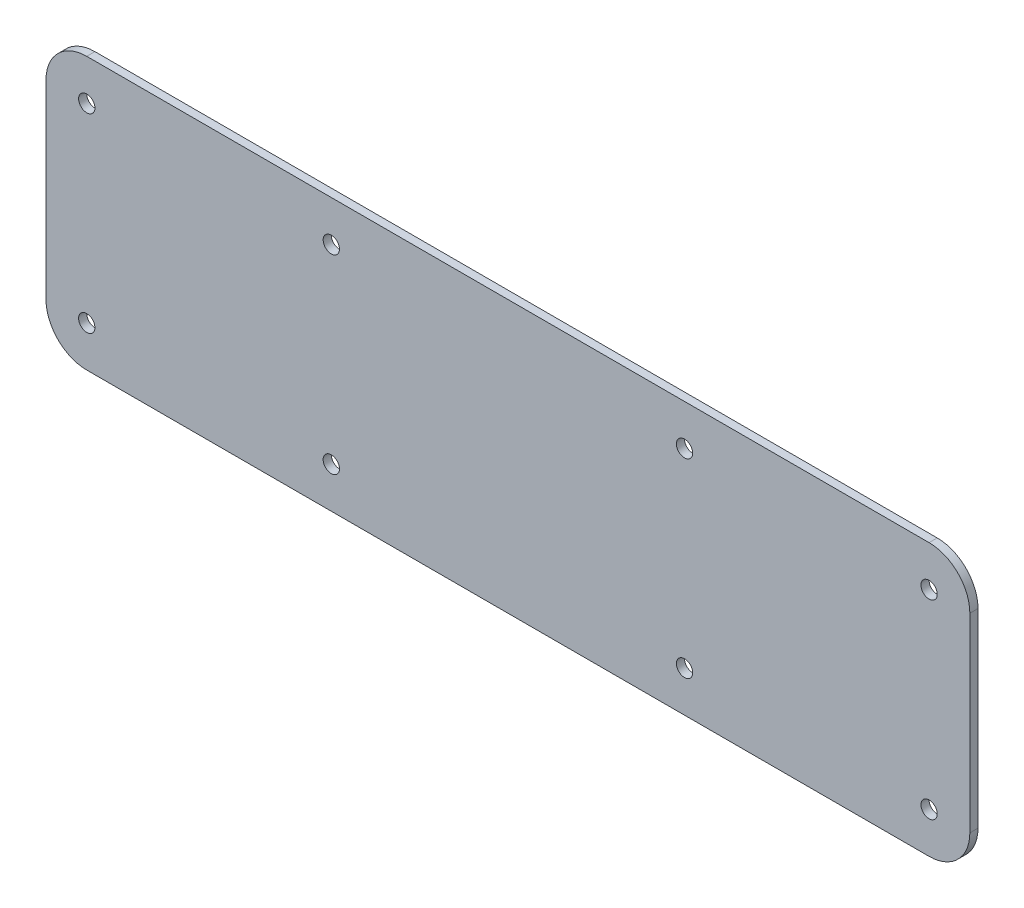
ISO-10303-21;
HEADER;
FILE_DESCRIPTION(('STEP AP214'),'2;1');
FILE_NAME('part.step','',(''),(''),'','','');
FILE_SCHEMA(('AUTOMOTIVE_DESIGN { 1 0 10303 214 1 1 1 1 }'));
ENDSEC;
DATA;
#1=APPLICATION_CONTEXT('core data for automotive mechanical design processes');
#2=APPLICATION_PROTOCOL_DEFINITION('international standard','automotive_design',2000,#1);
#3=PRODUCT_CONTEXT('',#1,'mechanical');
#4=PRODUCT('Part','Part','',(#3));
#5=PRODUCT_RELATED_PRODUCT_CATEGORY('part','',(#4));
#6=PRODUCT_DEFINITION_FORMATION('','',#4);
#7=PRODUCT_DEFINITION_CONTEXT('part definition',#1,'design');
#8=PRODUCT_DEFINITION('design','',#6,#7);
#9=PRODUCT_DEFINITION_SHAPE('','',#8);
#10=(LENGTH_UNIT() NAMED_UNIT(*) SI_UNIT(.MILLI.,.METRE.));
#11=(NAMED_UNIT(*) PLANE_ANGLE_UNIT() SI_UNIT($,.RADIAN.));
#12=(NAMED_UNIT(*) SI_UNIT($,.STERADIAN.) SOLID_ANGLE_UNIT());
#13=UNCERTAINTY_MEASURE_WITH_UNIT(LENGTH_MEASURE(1.E-05),#10,'distance_accuracy_value','');
#14=(GEOMETRIC_REPRESENTATION_CONTEXT(3) GLOBAL_UNCERTAINTY_ASSIGNED_CONTEXT((#13)) GLOBAL_UNIT_ASSIGNED_CONTEXT((#10,
#11,#12)) REPRESENTATION_CONTEXT('',''));
#15=CARTESIAN_POINT('',(0.,0.,0.));
#16=DIRECTION('',(0.,0.,1.));
#17=DIRECTION('',(1.,0.,0.));
#18=AXIS2_PLACEMENT_3D('',#15,#16,#17);
#19=CARTESIAN_POINT('',(77.5,17.5,1.5));
#20=DIRECTION('',(0.,0.,-1.));
#21=DIRECTION('',(-1.,0.,0.));
#22=AXIS2_PLACEMENT_3D('',#19,#20,#21);
#23=PLANE('',#22);
#24=CARTESIAN_POINT('',(77.5,17.5,1.5));
#25=DIRECTION('',(0.,0.,1.));
#26=DIRECTION('',(-1.,0.,0.));
#27=AXIS2_PLACEMENT_3D('',#24,#25,#26);
#28=CIRCLE('',#27,7.5);
#29=CARTESIAN_POINT('',(85.,17.5,1.5));
#30=VERTEX_POINT('',#29);
#31=CARTESIAN_POINT('',(77.5,25.,1.5));
#32=VERTEX_POINT('',#31);
#33=EDGE_CURVE('E145',#30,#32,#28,.T.);
#34=ORIENTED_EDGE('',*,*,#33,.T.);
#35=DIRECTION('',(-1.,0.,0.));
#36=VECTOR('',#35,1.);
#37=CARTESIAN_POINT('',(-77.5,25.,1.5));
#38=LINE('',#37,#36);
#39=CARTESIAN_POINT('',(-77.5,25.,1.5));
#40=VERTEX_POINT('',#39);
#41=EDGE_CURVE('E93',#32,#40,#38,.T.);
#42=ORIENTED_EDGE('',*,*,#41,.T.);
#43=CARTESIAN_POINT('',(-77.5,17.5,1.5));
#44=DIRECTION('',(0.,0.,1.));
#45=DIRECTION('',(-1.,0.,0.));
#46=AXIS2_PLACEMENT_3D('',#43,#44,#45);
#47=CIRCLE('',#46,7.5);
#48=CARTESIAN_POINT('',(-85.,17.5,1.5));
#49=VERTEX_POINT('',#48);
#50=EDGE_CURVE('E160',#40,#49,#47,.T.);
#51=ORIENTED_EDGE('',*,*,#50,.T.);
#52=DIRECTION('',(0.,-1.,0.));
#53=VECTOR('',#52,1.);
#54=CARTESIAN_POINT('',(-85.,-17.5,1.5));
#55=LINE('',#54,#53);
#56=CARTESIAN_POINT('',(-85.,-17.5,1.5));
#57=VERTEX_POINT('',#56);
#58=EDGE_CURVE('E173',#49,#57,#55,.T.);
#59=ORIENTED_EDGE('',*,*,#58,.T.);
#60=CARTESIAN_POINT('',(-77.5,-17.5,1.5));
#61=DIRECTION('',(0.,0.,1.));
#62=DIRECTION('',(-1.,0.,0.));
#63=AXIS2_PLACEMENT_3D('',#60,#61,#62);
#64=CIRCLE('',#63,7.5);
#65=CARTESIAN_POINT('',(-77.5,-25.,1.5));
#66=VERTEX_POINT('',#65);
#67=EDGE_CURVE('E112',#57,#66,#64,.T.);
#68=ORIENTED_EDGE('',*,*,#67,.T.);
#69=DIRECTION('',(1.,0.,0.));
#70=VECTOR('',#69,1.);
#71=CARTESIAN_POINT('',(-77.5,-25.,1.5));
#72=LINE('',#71,#70);
#73=CARTESIAN_POINT('',(77.5,-25.,1.5));
#74=VERTEX_POINT('',#73);
#75=EDGE_CURVE('E106',#66,#74,#72,.T.);
#76=ORIENTED_EDGE('',*,*,#75,.T.);
#77=CARTESIAN_POINT('',(77.5,-17.5,1.5));
#78=DIRECTION('',(0.,0.,1.));
#79=DIRECTION('',(1.,0.,0.));
#80=AXIS2_PLACEMENT_3D('',#77,#78,#79);
#81=CIRCLE('',#80,7.5);
#82=CARTESIAN_POINT('',(85.,-17.5,1.5));
#83=VERTEX_POINT('',#82);
#84=EDGE_CURVE('E110',#74,#83,#81,.T.);
#85=ORIENTED_EDGE('',*,*,#84,.T.);
#86=DIRECTION('',(0.,1.,0.));
#87=VECTOR('',#86,1.);
#88=CARTESIAN_POINT('',(85.,-17.5,1.5));
#89=LINE('',#88,#87);
#90=EDGE_CURVE('E50',#83,#30,#89,.T.);
#91=ORIENTED_EDGE('',*,*,#90,.T.);
#92=EDGE_LOOP('',(#34,#42,#51,#59,#68,#76,#85,#91));
#93=FACE_BOUND('',#92,.T.);
#94=CARTESIAN_POINT('',(-32.5,17.5,1.5));
#95=DIRECTION('',(0.,0.,1.));
#96=DIRECTION('',(1.,0.,0.));
#97=AXIS2_PLACEMENT_3D('',#94,#95,#96);
#98=CIRCLE('',#97,1.5);
#99=CARTESIAN_POINT('',(-31.,17.5,1.5));
#100=VERTEX_POINT('',#99);
#101=EDGE_CURVE('E134',#100,#100,#98,.T.);
#102=ORIENTED_EDGE('',*,*,#101,.F.);
#103=EDGE_LOOP('',(#102));
#104=FACE_BOUND('',#103,.T.);
#105=CARTESIAN_POINT('',(32.5,17.5,1.5));
#106=DIRECTION('',(0.,0.,1.));
#107=DIRECTION('',(1.,0.,0.));
#108=AXIS2_PLACEMENT_3D('',#105,#106,#107);
#109=CIRCLE('',#108,1.5);
#110=CARTESIAN_POINT('',(34.,17.5,1.5));
#111=VERTEX_POINT('',#110);
#112=EDGE_CURVE('E182',#111,#111,#109,.T.);
#113=ORIENTED_EDGE('',*,*,#112,.F.);
#114=EDGE_LOOP('',(#113));
#115=FACE_BOUND('',#114,.T.);
#116=CARTESIAN_POINT('',(77.5,17.5,1.5));
#117=DIRECTION('',(0.,0.,1.));
#118=DIRECTION('',(1.,0.,0.));
#119=AXIS2_PLACEMENT_3D('',#116,#117,#118);
#120=CIRCLE('',#119,1.5);
#121=CARTESIAN_POINT('',(79.,17.5,1.5));
#122=VERTEX_POINT('',#121);
#123=EDGE_CURVE('E188',#122,#122,#120,.T.);
#124=ORIENTED_EDGE('',*,*,#123,.F.);
#125=EDGE_LOOP('',(#124));
#126=FACE_BOUND('',#125,.T.);
#127=CARTESIAN_POINT('',(-77.5,17.5,1.5));
#128=DIRECTION('',(0.,0.,1.));
#129=DIRECTION('',(1.,0.,0.));
#130=AXIS2_PLACEMENT_3D('',#127,#128,#129);
#131=CIRCLE('',#130,1.5);
#132=CARTESIAN_POINT('',(-76.,17.5,1.5));
#133=VERTEX_POINT('',#132);
#134=EDGE_CURVE('E194',#133,#133,#131,.T.);
#135=ORIENTED_EDGE('',*,*,#134,.F.);
#136=EDGE_LOOP('',(#135));
#137=FACE_BOUND('',#136,.T.);
#138=CARTESIAN_POINT('',(-77.5,-17.5,1.5));
#139=DIRECTION('',(0.,0.,1.));
#140=DIRECTION('',(1.,0.,0.));
#141=AXIS2_PLACEMENT_3D('',#138,#139,#140);
#142=CIRCLE('',#141,1.5);
#143=CARTESIAN_POINT('',(-76.,-17.5,1.5));
#144=VERTEX_POINT('',#143);
#145=EDGE_CURVE('E200',#144,#144,#142,.T.);
#146=ORIENTED_EDGE('',*,*,#145,.F.);
#147=EDGE_LOOP('',(#146));
#148=FACE_BOUND('',#147,.T.);
#149=CARTESIAN_POINT('',(-32.5,-17.5,1.5));
#150=DIRECTION('',(0.,0.,1.));
#151=DIRECTION('',(1.,0.,0.));
#152=AXIS2_PLACEMENT_3D('',#149,#150,#151);
#153=CIRCLE('',#152,1.5);
#154=CARTESIAN_POINT('',(-31.,-17.5,1.5));
#155=VERTEX_POINT('',#154);
#156=EDGE_CURVE('E206',#155,#155,#153,.T.);
#157=ORIENTED_EDGE('',*,*,#156,.F.);
#158=EDGE_LOOP('',(#157));
#159=FACE_BOUND('',#158,.T.);
#160=CARTESIAN_POINT('',(32.5,-17.5,1.5));
#161=DIRECTION('',(0.,0.,1.));
#162=DIRECTION('',(1.,0.,0.));
#163=AXIS2_PLACEMENT_3D('',#160,#161,#162);
#164=CIRCLE('',#163,1.5);
#165=CARTESIAN_POINT('',(34.,-17.5,1.5));
#166=VERTEX_POINT('',#165);
#167=EDGE_CURVE('E212',#166,#166,#164,.T.);
#168=ORIENTED_EDGE('',*,*,#167,.F.);
#169=EDGE_LOOP('',(#168));
#170=FACE_BOUND('',#169,.T.);
#171=CARTESIAN_POINT('',(77.5,-17.5,1.5));
#172=DIRECTION('',(0.,0.,1.));
#173=DIRECTION('',(1.,0.,0.));
#174=AXIS2_PLACEMENT_3D('',#171,#172,#173);
#175=CIRCLE('',#174,1.5);
#176=CARTESIAN_POINT('',(79.,-17.5,1.5));
#177=VERTEX_POINT('',#176);
#178=EDGE_CURVE('E218',#177,#177,#175,.T.);
#179=ORIENTED_EDGE('',*,*,#178,.F.);
#180=EDGE_LOOP('',(#179));
#181=FACE_BOUND('',#180,.T.);
#182=ADVANCED_FACE('F33',(#93,#104,#115,#126,#137,#148,#159,#170,#181),#23,.F.);
#183=CARTESIAN_POINT('',(77.5,17.5,0.));
#184=DIRECTION('',(0.,0.,-1.));
#185=DIRECTION('',(-1.,0.,0.));
#186=AXIS2_PLACEMENT_3D('',#183,#184,#185);
#187=PLANE('',#186);
#188=CARTESIAN_POINT('',(32.5,-17.5,0.));
#189=DIRECTION('',(0.,0.,1.));
#190=DIRECTION('',(1.,0.,0.));
#191=AXIS2_PLACEMENT_3D('',#188,#189,#190);
#192=CIRCLE('',#191,1.5);
#193=CARTESIAN_POINT('',(34.,-17.5,0.));
#194=VERTEX_POINT('',#193);
#195=EDGE_CURVE('E215',#194,#194,#192,.T.);
#196=ORIENTED_EDGE('',*,*,#195,.T.);
#197=EDGE_LOOP('',(#196));
#198=FACE_BOUND('',#197,.T.);
#199=CARTESIAN_POINT('',(-77.5,-17.5,0.));
#200=DIRECTION('',(0.,0.,1.));
#201=DIRECTION('',(1.,0.,0.));
#202=AXIS2_PLACEMENT_3D('',#199,#200,#201);
#203=CIRCLE('',#202,1.5);
#204=CARTESIAN_POINT('',(-76.,-17.5,0.));
#205=VERTEX_POINT('',#204);
#206=EDGE_CURVE('E203',#205,#205,#203,.T.);
#207=ORIENTED_EDGE('',*,*,#206,.T.);
#208=EDGE_LOOP('',(#207));
#209=FACE_BOUND('',#208,.T.);
#210=CARTESIAN_POINT('',(77.5,17.5,0.));
#211=DIRECTION('',(0.,0.,1.));
#212=DIRECTION('',(1.,0.,0.));
#213=AXIS2_PLACEMENT_3D('',#210,#211,#212);
#214=CIRCLE('',#213,1.5);
#215=CARTESIAN_POINT('',(79.,17.5,0.));
#216=VERTEX_POINT('',#215);
#217=EDGE_CURVE('E191',#216,#216,#214,.T.);
#218=ORIENTED_EDGE('',*,*,#217,.T.);
#219=EDGE_LOOP('',(#218));
#220=FACE_BOUND('',#219,.T.);
#221=CARTESIAN_POINT('',(-32.5,17.5,0.));
#222=DIRECTION('',(0.,0.,1.));
#223=DIRECTION('',(1.,0.,0.));
#224=AXIS2_PLACEMENT_3D('',#221,#222,#223);
#225=CIRCLE('',#224,1.5);
#226=CARTESIAN_POINT('',(-31.,17.5,0.));
#227=VERTEX_POINT('',#226);
#228=EDGE_CURVE('E179',#227,#227,#225,.T.);
#229=ORIENTED_EDGE('',*,*,#228,.T.);
#230=EDGE_LOOP('',(#229));
#231=FACE_BOUND('',#230,.T.);
#232=CARTESIAN_POINT('',(77.5,17.5,0.));
#233=DIRECTION('',(0.,0.,1.));
#234=DIRECTION('',(-1.,0.,0.));
#235=AXIS2_PLACEMENT_3D('',#232,#233,#234);
#236=CIRCLE('',#235,7.5);
#237=CARTESIAN_POINT('',(85.,17.5,0.));
#238=VERTEX_POINT('',#237);
#239=CARTESIAN_POINT('',(77.5,25.,0.));
#240=VERTEX_POINT('',#239);
#241=EDGE_CURVE('E130',#238,#240,#236,.T.);
#242=ORIENTED_EDGE('',*,*,#241,.F.);
#243=DIRECTION('',(0.,1.,0.));
#244=VECTOR('',#243,1.);
#245=CARTESIAN_POINT('',(85.,-17.5,0.));
#246=LINE('',#245,#244);
#247=CARTESIAN_POINT('',(85.,-17.5,0.));
#248=VERTEX_POINT('',#247);
#249=EDGE_CURVE('E85',#248,#238,#246,.T.);
#250=ORIENTED_EDGE('',*,*,#249,.F.);
#251=CARTESIAN_POINT('',(77.5,-17.5,0.));
#252=DIRECTION('',(0.,0.,1.));
#253=DIRECTION('',(1.,0.,0.));
#254=AXIS2_PLACEMENT_3D('',#251,#252,#253);
#255=CIRCLE('',#254,7.5);
#256=CARTESIAN_POINT('',(77.5,-25.,0.));
#257=VERTEX_POINT('',#256);
#258=EDGE_CURVE('E79',#257,#248,#255,.T.);
#259=ORIENTED_EDGE('',*,*,#258,.F.);
#260=DIRECTION('',(1.,0.,0.));
#261=VECTOR('',#260,1.);
#262=CARTESIAN_POINT('',(-77.5,-25.,0.));
#263=LINE('',#262,#261);
#264=CARTESIAN_POINT('',(-77.5,-25.,0.));
#265=VERTEX_POINT('',#264);
#266=EDGE_CURVE('E120',#265,#257,#263,.T.);
#267=ORIENTED_EDGE('',*,*,#266,.F.);
#268=CARTESIAN_POINT('',(-77.5,-17.5,0.));
#269=DIRECTION('',(0.,0.,1.));
#270=DIRECTION('',(-1.,0.,0.));
#271=AXIS2_PLACEMENT_3D('',#268,#269,#270);
#272=CIRCLE('',#271,7.5);
#273=CARTESIAN_POINT('',(-85.,-17.5,0.));
#274=VERTEX_POINT('',#273);
#275=EDGE_CURVE('E140',#274,#265,#272,.T.);
#276=ORIENTED_EDGE('',*,*,#275,.F.);
#277=DIRECTION('',(0.,-1.,0.));
#278=VECTOR('',#277,1.);
#279=CARTESIAN_POINT('',(-85.,-17.5,0.));
#280=LINE('',#279,#278);
#281=CARTESIAN_POINT('',(-85.,17.5,0.));
#282=VERTEX_POINT('',#281);
#283=EDGE_CURVE('E138',#282,#274,#280,.T.);
#284=ORIENTED_EDGE('',*,*,#283,.F.);
#285=CARTESIAN_POINT('',(-77.5,17.5,0.));
#286=DIRECTION('',(0.,0.,1.));
#287=DIRECTION('',(-1.,0.,0.));
#288=AXIS2_PLACEMENT_3D('',#285,#286,#287);
#289=CIRCLE('',#288,7.5);
#290=CARTESIAN_POINT('',(-77.5,25.,0.));
#291=VERTEX_POINT('',#290);
#292=EDGE_CURVE('E136',#291,#282,#289,.T.);
#293=ORIENTED_EDGE('',*,*,#292,.F.);
#294=DIRECTION('',(-1.,0.,0.));
#295=VECTOR('',#294,1.);
#296=CARTESIAN_POINT('',(-77.5,25.,0.));
#297=LINE('',#296,#295);
#298=EDGE_CURVE('E133',#240,#291,#297,.T.);
#299=ORIENTED_EDGE('',*,*,#298,.F.);
#300=EDGE_LOOP('',(#242,#250,#259,#267,#276,#284,#293,#299));
#301=FACE_BOUND('',#300,.T.);
#302=CARTESIAN_POINT('',(32.5,17.5,0.));
#303=DIRECTION('',(0.,0.,1.));
#304=DIRECTION('',(1.,0.,0.));
#305=AXIS2_PLACEMENT_3D('',#302,#303,#304);
#306=CIRCLE('',#305,1.5);
#307=CARTESIAN_POINT('',(34.,17.5,0.));
#308=VERTEX_POINT('',#307);
#309=EDGE_CURVE('E185',#308,#308,#306,.T.);
#310=ORIENTED_EDGE('',*,*,#309,.T.);
#311=EDGE_LOOP('',(#310));
#312=FACE_BOUND('',#311,.T.);
#313=CARTESIAN_POINT('',(-77.5,17.5,0.));
#314=DIRECTION('',(0.,0.,1.));
#315=DIRECTION('',(1.,0.,0.));
#316=AXIS2_PLACEMENT_3D('',#313,#314,#315);
#317=CIRCLE('',#316,1.5);
#318=CARTESIAN_POINT('',(-76.,17.5,0.));
#319=VERTEX_POINT('',#318);
#320=EDGE_CURVE('E197',#319,#319,#317,.T.);
#321=ORIENTED_EDGE('',*,*,#320,.T.);
#322=EDGE_LOOP('',(#321));
#323=FACE_BOUND('',#322,.T.);
#324=CARTESIAN_POINT('',(-32.5,-17.5,0.));
#325=DIRECTION('',(0.,0.,1.));
#326=DIRECTION('',(1.,0.,0.));
#327=AXIS2_PLACEMENT_3D('',#324,#325,#326);
#328=CIRCLE('',#327,1.5);
#329=CARTESIAN_POINT('',(-31.,-17.5,0.));
#330=VERTEX_POINT('',#329);
#331=EDGE_CURVE('E209',#330,#330,#328,.T.);
#332=ORIENTED_EDGE('',*,*,#331,.T.);
#333=EDGE_LOOP('',(#332));
#334=FACE_BOUND('',#333,.T.);
#335=CARTESIAN_POINT('',(77.5,-17.5,0.));
#336=DIRECTION('',(0.,0.,1.));
#337=DIRECTION('',(1.,0.,0.));
#338=AXIS2_PLACEMENT_3D('',#335,#336,#337);
#339=CIRCLE('',#338,1.5);
#340=CARTESIAN_POINT('',(79.,-17.5,0.));
#341=VERTEX_POINT('',#340);
#342=EDGE_CURVE('E221',#341,#341,#339,.T.);
#343=ORIENTED_EDGE('',*,*,#342,.T.);
#344=EDGE_LOOP('',(#343));
#345=FACE_BOUND('',#344,.T.);
#346=ADVANCED_FACE('F164',(#198,#209,#220,#231,#301,#312,#323,#334,#345),#187,.T.);
#347=CARTESIAN_POINT('',(77.5,17.5,1.5));
#348=DIRECTION('',(0.,0.,-1.));
#349=DIRECTION('',(-1.,0.,0.));
#350=AXIS2_PLACEMENT_3D('',#347,#348,#349);
#351=CYLINDRICAL_SURFACE('',#350,7.5);
#352=ORIENTED_EDGE('',*,*,#241,.T.);
#353=DIRECTION('',(0.,0.,-1.));
#354=VECTOR('',#353,1.);
#355=CARTESIAN_POINT('',(77.5,25.,1.5));
#356=LINE('',#355,#354);
#357=EDGE_CURVE('E11',#32,#240,#356,.T.);
#358=ORIENTED_EDGE('',*,*,#357,.F.);
#359=ORIENTED_EDGE('',*,*,#33,.F.);
#360=DIRECTION('',(0.,0.,-1.));
#361=VECTOR('',#360,1.);
#362=CARTESIAN_POINT('',(85.,17.5,1.5));
#363=LINE('',#362,#361);
#364=EDGE_CURVE('E126',#30,#238,#363,.T.);
#365=ORIENTED_EDGE('',*,*,#364,.T.);
#366=EDGE_LOOP('',(#352,#358,#359,#365));
#367=FACE_BOUND('',#366,.T.);
#368=ADVANCED_FACE('F35',(#367),#351,.T.);
#369=CARTESIAN_POINT('',(-77.5,25.,1.5));
#370=DIRECTION('',(0.,-1.,0.));
#371=DIRECTION('',(0.,0.,-1.));
#372=AXIS2_PLACEMENT_3D('',#369,#370,#371);
#373=PLANE('',#372);
#374=ORIENTED_EDGE('',*,*,#298,.T.);
#375=DIRECTION('',(0.,0.,-1.));
#376=VECTOR('',#375,1.);
#377=CARTESIAN_POINT('',(-77.5,25.,1.5));
#378=LINE('',#377,#376);
#379=EDGE_CURVE('E42',#40,#291,#378,.T.);
#380=ORIENTED_EDGE('',*,*,#379,.F.);
#381=ORIENTED_EDGE('',*,*,#41,.F.);
#382=ORIENTED_EDGE('',*,*,#357,.T.);
#383=EDGE_LOOP('',(#374,#380,#381,#382));
#384=FACE_BOUND('',#383,.T.);
#385=ADVANCED_FACE('F253',(#384),#373,.F.);
#386=CARTESIAN_POINT('',(-77.5,17.5,1.5));
#387=DIRECTION('',(0.,0.,-1.));
#388=DIRECTION('',(-1.,0.,0.));
#389=AXIS2_PLACEMENT_3D('',#386,#387,#388);
#390=CYLINDRICAL_SURFACE('',#389,7.5);
#391=ORIENTED_EDGE('',*,*,#292,.T.);
#392=DIRECTION('',(0.,0.,-1.));
#393=VECTOR('',#392,1.);
#394=CARTESIAN_POINT('',(-85.,17.5,1.5));
#395=LINE('',#394,#393);
#396=EDGE_CURVE('E152',#49,#282,#395,.T.);
#397=ORIENTED_EDGE('',*,*,#396,.F.);
#398=ORIENTED_EDGE('',*,*,#50,.F.);
#399=ORIENTED_EDGE('',*,*,#379,.T.);
#400=EDGE_LOOP('',(#391,#397,#398,#399));
#401=FACE_BOUND('',#400,.T.);
#402=ADVANCED_FACE('F158',(#401),#390,.T.);
#403=CARTESIAN_POINT('',(-85.,-17.5,1.5));
#404=DIRECTION('',(1.,0.,0.));
#405=DIRECTION('',(0.,0.,-1.));
#406=AXIS2_PLACEMENT_3D('',#403,#404,#405);
#407=PLANE('',#406);
#408=ORIENTED_EDGE('',*,*,#283,.T.);
#409=DIRECTION('',(0.,0.,-1.));
#410=VECTOR('',#409,1.);
#411=CARTESIAN_POINT('',(-85.,-17.5,1.5));
#412=LINE('',#411,#410);
#413=EDGE_CURVE('E149',#57,#274,#412,.T.);
#414=ORIENTED_EDGE('',*,*,#413,.F.);
#415=ORIENTED_EDGE('',*,*,#58,.F.);
#416=ORIENTED_EDGE('',*,*,#396,.T.);
#417=EDGE_LOOP('',(#408,#414,#415,#416));
#418=FACE_BOUND('',#417,.T.);
#419=ADVANCED_FACE('F169',(#418),#407,.F.);
#420=CARTESIAN_POINT('',(-77.5,-17.5,1.5));
#421=DIRECTION('',(0.,0.,-1.));
#422=DIRECTION('',(-1.,0.,0.));
#423=AXIS2_PLACEMENT_3D('',#420,#421,#422);
#424=CYLINDRICAL_SURFACE('',#423,7.5);
#425=ORIENTED_EDGE('',*,*,#275,.T.);
#426=DIRECTION('',(0.,0.,-1.));
#427=VECTOR('',#426,1.);
#428=CARTESIAN_POINT('',(-77.5,-25.,1.5));
#429=LINE('',#428,#427);
#430=EDGE_CURVE('E121',#66,#265,#429,.T.);
#431=ORIENTED_EDGE('',*,*,#430,.F.);
#432=ORIENTED_EDGE('',*,*,#67,.F.);
#433=ORIENTED_EDGE('',*,*,#413,.T.);
#434=EDGE_LOOP('',(#425,#431,#432,#433));
#435=FACE_BOUND('',#434,.T.);
#436=ADVANCED_FACE('F172',(#435),#424,.T.);
#437=CARTESIAN_POINT('',(-77.5,-25.,1.5));
#438=DIRECTION('',(0.,1.,0.));
#439=DIRECTION('',(0.,0.,1.));
#440=AXIS2_PLACEMENT_3D('',#437,#438,#439);
#441=PLANE('',#440);
#442=ORIENTED_EDGE('',*,*,#266,.T.);
#443=DIRECTION('',(0.,0.,-1.));
#444=VECTOR('',#443,1.);
#445=CARTESIAN_POINT('',(77.5,-25.,1.5));
#446=LINE('',#445,#444);
#447=EDGE_CURVE('E117',#74,#257,#446,.T.);
#448=ORIENTED_EDGE('',*,*,#447,.F.);
#449=ORIENTED_EDGE('',*,*,#75,.F.);
#450=ORIENTED_EDGE('',*,*,#430,.T.);
#451=EDGE_LOOP('',(#442,#448,#449,#450));
#452=FACE_BOUND('',#451,.T.);
#453=ADVANCED_FACE('F118',(#452),#441,.F.);
#454=CARTESIAN_POINT('',(77.5,-17.5,1.5));
#455=DIRECTION('',(0.,0.,-1.));
#456=DIRECTION('',(-1.,0.,0.));
#457=AXIS2_PLACEMENT_3D('',#454,#455,#456);
#458=CYLINDRICAL_SURFACE('',#457,7.5);
#459=ORIENTED_EDGE('',*,*,#258,.T.);
#460=DIRECTION('',(0.,0.,-1.));
#461=VECTOR('',#460,1.);
#462=CARTESIAN_POINT('',(85.,-17.5,1.5));
#463=LINE('',#462,#461);
#464=EDGE_CURVE('E122',#83,#248,#463,.T.);
#465=ORIENTED_EDGE('',*,*,#464,.F.);
#466=ORIENTED_EDGE('',*,*,#84,.F.);
#467=ORIENTED_EDGE('',*,*,#447,.T.);
#468=EDGE_LOOP('',(#459,#465,#466,#467));
#469=FACE_BOUND('',#468,.T.);
#470=ADVANCED_FACE('F124',(#469),#458,.T.);
#471=CARTESIAN_POINT('',(85.,-17.5,1.5));
#472=DIRECTION('',(-1.,0.,0.));
#473=DIRECTION('',(0.,0.,1.));
#474=AXIS2_PLACEMENT_3D('',#471,#472,#473);
#475=PLANE('',#474);
#476=ORIENTED_EDGE('',*,*,#249,.T.);
#477=ORIENTED_EDGE('',*,*,#364,.F.);
#478=ORIENTED_EDGE('',*,*,#90,.F.);
#479=ORIENTED_EDGE('',*,*,#464,.T.);
#480=EDGE_LOOP('',(#476,#477,#478,#479));
#481=FACE_BOUND('',#480,.T.);
#482=ADVANCED_FACE('F241',(#481),#475,.F.);
#483=CARTESIAN_POINT('',(-32.5,17.5,1.5));
#484=DIRECTION('',(0.,0.,-1.));
#485=DIRECTION('',(-1.,0.,0.));
#486=AXIS2_PLACEMENT_3D('',#483,#484,#485);
#487=CYLINDRICAL_SURFACE('',#486,1.5);
#488=ORIENTED_EDGE('',*,*,#101,.T.);
#489=EDGE_LOOP('',(#488));
#490=FACE_BOUND('',#489,.T.);
#491=ORIENTED_EDGE('',*,*,#228,.F.);
#492=EDGE_LOOP('',(#491));
#493=FACE_BOUND('',#492,.T.);
#494=ADVANCED_FACE('F238',(#490,#493),#487,.F.);
#495=CARTESIAN_POINT('',(32.5,17.5,1.5));
#496=DIRECTION('',(0.,0.,-1.));
#497=DIRECTION('',(-1.,0.,0.));
#498=AXIS2_PLACEMENT_3D('',#495,#496,#497);
#499=CYLINDRICAL_SURFACE('',#498,1.5);
#500=ORIENTED_EDGE('',*,*,#112,.T.);
#501=EDGE_LOOP('',(#500));
#502=FACE_BOUND('',#501,.T.);
#503=ORIENTED_EDGE('',*,*,#309,.F.);
#504=EDGE_LOOP('',(#503));
#505=FACE_BOUND('',#504,.T.);
#506=ADVANCED_FACE('F317',(#502,#505),#499,.F.);
#507=CARTESIAN_POINT('',(77.5,17.5,1.5));
#508=DIRECTION('',(0.,0.,-1.));
#509=DIRECTION('',(-1.,0.,0.));
#510=AXIS2_PLACEMENT_3D('',#507,#508,#509);
#511=CYLINDRICAL_SURFACE('',#510,1.5);
#512=ORIENTED_EDGE('',*,*,#123,.T.);
#513=EDGE_LOOP('',(#512));
#514=FACE_BOUND('',#513,.T.);
#515=ORIENTED_EDGE('',*,*,#217,.F.);
#516=EDGE_LOOP('',(#515));
#517=FACE_BOUND('',#516,.T.);
#518=ADVANCED_FACE('F325',(#514,#517),#511,.F.);
#519=CARTESIAN_POINT('',(-77.5,17.5,1.5));
#520=DIRECTION('',(0.,0.,-1.));
#521=DIRECTION('',(-1.,0.,0.));
#522=AXIS2_PLACEMENT_3D('',#519,#520,#521);
#523=CYLINDRICAL_SURFACE('',#522,1.5);
#524=ORIENTED_EDGE('',*,*,#134,.T.);
#525=EDGE_LOOP('',(#524));
#526=FACE_BOUND('',#525,.T.);
#527=ORIENTED_EDGE('',*,*,#320,.F.);
#528=EDGE_LOOP('',(#527));
#529=FACE_BOUND('',#528,.T.);
#530=ADVANCED_FACE('F333',(#526,#529),#523,.F.);
#531=CARTESIAN_POINT('',(-77.5,-17.5,1.5));
#532=DIRECTION('',(0.,0.,-1.));
#533=DIRECTION('',(-1.,0.,0.));
#534=AXIS2_PLACEMENT_3D('',#531,#532,#533);
#535=CYLINDRICAL_SURFACE('',#534,1.5);
#536=ORIENTED_EDGE('',*,*,#145,.T.);
#537=EDGE_LOOP('',(#536));
#538=FACE_BOUND('',#537,.T.);
#539=ORIENTED_EDGE('',*,*,#206,.F.);
#540=EDGE_LOOP('',(#539));
#541=FACE_BOUND('',#540,.T.);
#542=ADVANCED_FACE('F342',(#538,#541),#535,.F.);
#543=CARTESIAN_POINT('',(-32.5,-17.5,1.5));
#544=DIRECTION('',(0.,0.,-1.));
#545=DIRECTION('',(-1.,0.,0.));
#546=AXIS2_PLACEMENT_3D('',#543,#544,#545);
#547=CYLINDRICAL_SURFACE('',#546,1.5);
#548=ORIENTED_EDGE('',*,*,#156,.T.);
#549=EDGE_LOOP('',(#548));
#550=FACE_BOUND('',#549,.T.);
#551=ORIENTED_EDGE('',*,*,#331,.F.);
#552=EDGE_LOOP('',(#551));
#553=FACE_BOUND('',#552,.T.);
#554=ADVANCED_FACE('F351',(#550,#553),#547,.F.);
#555=CARTESIAN_POINT('',(32.5,-17.5,1.5));
#556=DIRECTION('',(0.,0.,-1.));
#557=DIRECTION('',(-1.,0.,0.));
#558=AXIS2_PLACEMENT_3D('',#555,#556,#557);
#559=CYLINDRICAL_SURFACE('',#558,1.5);
#560=ORIENTED_EDGE('',*,*,#167,.T.);
#561=EDGE_LOOP('',(#560));
#562=FACE_BOUND('',#561,.T.);
#563=ORIENTED_EDGE('',*,*,#195,.F.);
#564=EDGE_LOOP('',(#563));
#565=FACE_BOUND('',#564,.T.);
#566=ADVANCED_FACE('F360',(#562,#565),#559,.F.);
#567=CARTESIAN_POINT('',(77.5,-17.5,1.5));
#568=DIRECTION('',(0.,0.,-1.));
#569=DIRECTION('',(-1.,0.,0.));
#570=AXIS2_PLACEMENT_3D('',#567,#568,#569);
#571=CYLINDRICAL_SURFACE('',#570,1.5);
#572=ORIENTED_EDGE('',*,*,#178,.T.);
#573=EDGE_LOOP('',(#572));
#574=FACE_BOUND('',#573,.T.);
#575=ORIENTED_EDGE('',*,*,#342,.F.);
#576=EDGE_LOOP('',(#575));
#577=FACE_BOUND('',#576,.T.);
#578=ADVANCED_FACE('F227',(#574,#577),#571,.F.);
#579=CLOSED_SHELL('',(#182,#346,#368,#385,#402,#419,#436,#453,#470,#482,#494,#506,#518,#530,
#542,#554,#566,#578));
#580=MANIFOLD_SOLID_BREP('B2',#579);
#581=ADVANCED_BREP_SHAPE_REPRESENTATION('',(#18,#580),#14);
#582=SHAPE_DEFINITION_REPRESENTATION(#9,#581);
ENDSEC;
END-ISO-10303-21;
